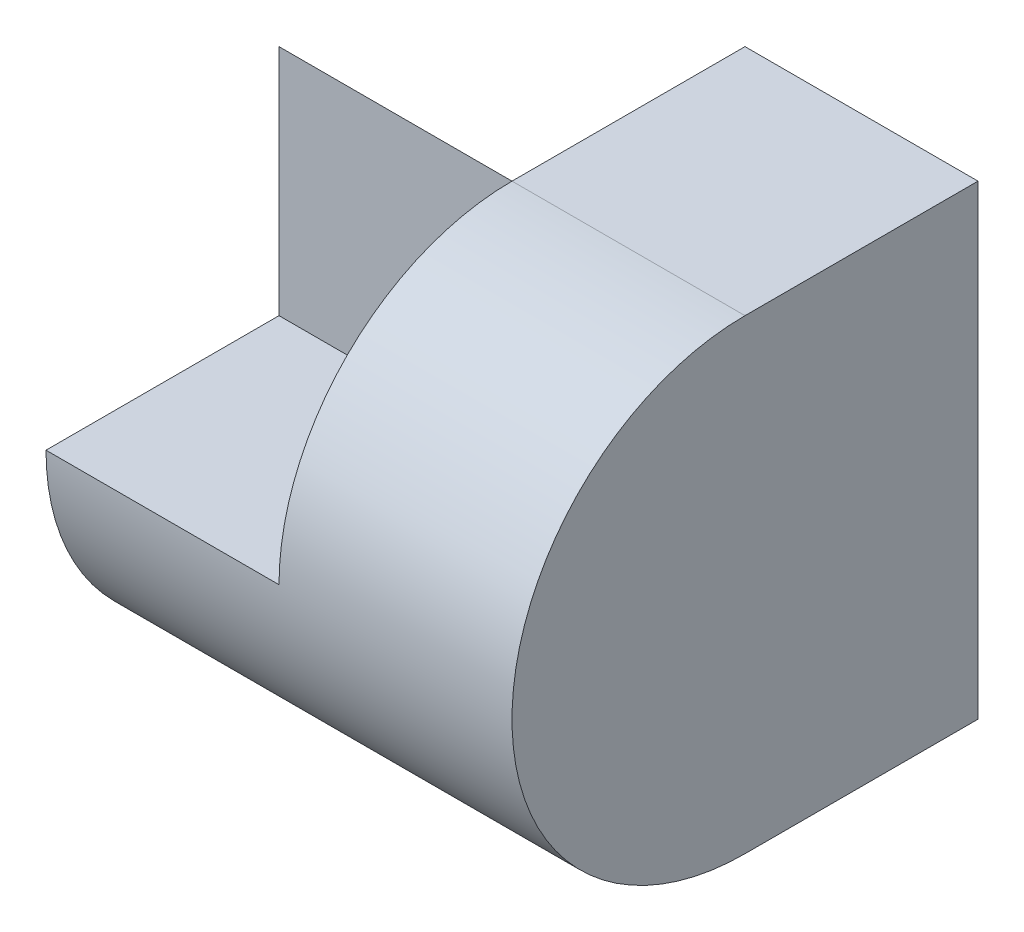
ISO-10303-21;
HEADER;
FILE_DESCRIPTION(('STEP AP214'),'2;1');
FILE_NAME('part.step','',(''),(''),'','','');
FILE_SCHEMA(('AUTOMOTIVE_DESIGN { 1 0 10303 214 1 1 1 1 }'));
ENDSEC;
DATA;
#1=APPLICATION_CONTEXT('core data for automotive mechanical design processes');
#2=APPLICATION_PROTOCOL_DEFINITION('international standard','automotive_design',2000,#1);
#3=PRODUCT_CONTEXT('',#1,'mechanical');
#4=PRODUCT('Part','Part','',(#3));
#5=PRODUCT_RELATED_PRODUCT_CATEGORY('part','',(#4));
#6=PRODUCT_DEFINITION_FORMATION('','',#4);
#7=PRODUCT_DEFINITION_CONTEXT('part definition',#1,'design');
#8=PRODUCT_DEFINITION('design','',#6,#7);
#9=PRODUCT_DEFINITION_SHAPE('','',#8);
#10=(LENGTH_UNIT() NAMED_UNIT(*) SI_UNIT(.MILLI.,.METRE.));
#11=(NAMED_UNIT(*) PLANE_ANGLE_UNIT() SI_UNIT($,.RADIAN.));
#12=(NAMED_UNIT(*) SI_UNIT($,.STERADIAN.) SOLID_ANGLE_UNIT());
#13=UNCERTAINTY_MEASURE_WITH_UNIT(LENGTH_MEASURE(1.E-05),#10,'distance_accuracy_value','');
#14=(GEOMETRIC_REPRESENTATION_CONTEXT(3) GLOBAL_UNCERTAINTY_ASSIGNED_CONTEXT((#13)) GLOBAL_UNIT_ASSIGNED_CONTEXT((#10,
#11,#12)) REPRESENTATION_CONTEXT('',''));
#15=CARTESIAN_POINT('',(0.,0.,0.));
#16=DIRECTION('',(0.,0.,1.));
#17=DIRECTION('',(1.,0.,0.));
#18=AXIS2_PLACEMENT_3D('',#15,#16,#17);
#19=CARTESIAN_POINT('',(2.,4.,2.));
#20=DIRECTION('',(-1.,0.,0.));
#21=DIRECTION('',(0.,0.,1.));
#22=AXIS2_PLACEMENT_3D('',#19,#20,#21);
#23=PLANE('',#22);
#24=CARTESIAN_POINT('',(2.,2.,0.));
#25=DIRECTION('',(-1.,0.,0.));
#26=DIRECTION('',(0.,0.,1.));
#27=AXIS2_PLACEMENT_3D('',#24,#25,#26);
#28=CIRCLE('',#27,2.);
#29=CARTESIAN_POINT('',(2.,4.,0.));
#30=VERTEX_POINT('',#29);
#31=CARTESIAN_POINT('',(2.,0.,0.));
#32=VERTEX_POINT('',#31);
#33=EDGE_CURVE('E168',#30,#32,#28,.F.);
#34=ORIENTED_EDGE('',*,*,#33,.T.);
#35=DIRECTION('',(0.,0.,-1.));
#36=VECTOR('',#35,1.);
#37=CARTESIAN_POINT('',(2.,0.,2.));
#38=LINE('',#37,#36);
#39=CARTESIAN_POINT('',(2.,0.,-2.));
#40=VERTEX_POINT('',#39);
#41=EDGE_CURVE('E107',#32,#40,#38,.T.);
#42=ORIENTED_EDGE('',*,*,#41,.T.);
#43=DIRECTION('',(0.,-1.,0.));
#44=VECTOR('',#43,1.);
#45=CARTESIAN_POINT('',(2.,4.,-2.));
#46=LINE('',#45,#44);
#47=CARTESIAN_POINT('',(2.,4.,-2.));
#48=VERTEX_POINT('',#47);
#49=EDGE_CURVE('E79',#48,#40,#46,.T.);
#50=ORIENTED_EDGE('',*,*,#49,.F.);
#51=DIRECTION('',(0.,0.,-1.));
#52=VECTOR('',#51,1.);
#53=CARTESIAN_POINT('',(2.,4.,2.));
#54=LINE('',#53,#52);
#55=EDGE_CURVE('E93',#30,#48,#54,.T.);
#56=ORIENTED_EDGE('',*,*,#55,.F.);
#57=EDGE_LOOP('',(#34,#42,#50,#56));
#58=FACE_BOUND('',#57,.T.);
#59=ADVANCED_FACE('F72',(#58),#23,.F.);
#60=CARTESIAN_POINT('',(-2.,4.,2.));
#61=DIRECTION('',(1.,0.,0.));
#62=DIRECTION('',(0.,0.,-1.));
#63=AXIS2_PLACEMENT_3D('',#60,#61,#62);
#64=PLANE('',#63);
#65=DIRECTION('',(0.,0.,1.));
#66=VECTOR('',#65,1.);
#67=CARTESIAN_POINT('',(-2.,0.,2.));
#68=LINE('',#67,#66);
#69=CARTESIAN_POINT('',(-2.,0.,-2.));
#70=VERTEX_POINT('',#69);
#71=CARTESIAN_POINT('',(-2.,0.,0.));
#72=VERTEX_POINT('',#71);
#73=EDGE_CURVE('E184',#70,#72,#68,.T.);
#74=ORIENTED_EDGE('',*,*,#73,.T.);
#75=CARTESIAN_POINT('',(-2.,2.,0.));
#76=DIRECTION('',(1.,0.,0.));
#77=DIRECTION('',(0.,0.,-1.));
#78=AXIS2_PLACEMENT_3D('',#75,#76,#77);
#79=CIRCLE('',#78,2.);
#80=CARTESIAN_POINT('',(-2.,2.,2.));
#81=VERTEX_POINT('',#80);
#82=EDGE_CURVE('E201',#72,#81,#79,.F.);
#83=ORIENTED_EDGE('',*,*,#82,.T.);
#84=DIRECTION('',(0.,0.,1.));
#85=VECTOR('',#84,1.);
#86=CARTESIAN_POINT('',(-2.,2.,0.));
#87=LINE('',#86,#85);
#88=CARTESIAN_POINT('',(-2.,2.,0.));
#89=VERTEX_POINT('',#88);
#90=EDGE_CURVE('E154',#89,#81,#87,.T.);
#91=ORIENTED_EDGE('',*,*,#90,.F.);
#92=DIRECTION('',(0.,-1.,0.));
#93=VECTOR('',#92,1.);
#94=CARTESIAN_POINT('',(-2.,0.,0.));
#95=LINE('',#94,#93);
#96=CARTESIAN_POINT('',(-2.,4.,0.));
#97=VERTEX_POINT('',#96);
#98=EDGE_CURVE('E165',#97,#89,#95,.T.);
#99=ORIENTED_EDGE('',*,*,#98,.F.);
#100=DIRECTION('',(0.,0.707106781186548,0.707106781186548));
#101=VECTOR('',#100,1.);
#102=CARTESIAN_POINT('',(-2.,2.,-2.));
#103=LINE('',#102,#101);
#104=CARTESIAN_POINT('',(-2.,2.,-2.));
#105=VERTEX_POINT('',#104);
#106=EDGE_CURVE('E155',#105,#97,#103,.T.);
#107=ORIENTED_EDGE('',*,*,#106,.F.);
#108=DIRECTION('',(0.,-1.,0.));
#109=VECTOR('',#108,1.);
#110=CARTESIAN_POINT('',(-2.,4.,-2.));
#111=LINE('',#110,#109);
#112=EDGE_CURVE('E186',#105,#70,#111,.T.);
#113=ORIENTED_EDGE('',*,*,#112,.T.);
#114=EDGE_LOOP('',(#74,#83,#91,#99,#107,#113));
#115=FACE_BOUND('',#114,.T.);
#116=ADVANCED_FACE('F206',(#115),#64,.F.);
#117=CARTESIAN_POINT('',(0.,0.,0.));
#118=DIRECTION('',(-1.,0.,0.));
#119=DIRECTION('',(0.,0.,1.));
#120=AXIS2_PLACEMENT_3D('',#117,#118,#119);
#121=PLANE('',#120);
#122=CARTESIAN_POINT('',(0.,2.,0.));
#123=DIRECTION('',(-1.,0.,0.));
#124=DIRECTION('',(0.,0.,1.));
#125=AXIS2_PLACEMENT_3D('',#122,#123,#124);
#126=CIRCLE('',#125,2.);
#127=CARTESIAN_POINT('',(0.,4.,0.));
#128=VERTEX_POINT('',#127);
#129=CARTESIAN_POINT('',(0.,2.,2.));
#130=VERTEX_POINT('',#129);
#131=EDGE_CURVE('E12',#128,#130,#126,.F.);
#132=ORIENTED_EDGE('',*,*,#131,.F.);
#133=DIRECTION('',(0.,-1.,0.));
#134=VECTOR('',#133,1.);
#135=CARTESIAN_POINT('',(0.,0.,0.));
#136=LINE('',#135,#134);
#137=CARTESIAN_POINT('',(0.,2.,0.));
#138=VERTEX_POINT('',#137);
#139=EDGE_CURVE('E159',#128,#138,#136,.T.);
#140=ORIENTED_EDGE('',*,*,#139,.T.);
#141=DIRECTION('',(0.,0.,1.));
#142=VECTOR('',#141,1.);
#143=CARTESIAN_POINT('',(0.,2.,0.));
#144=LINE('',#143,#142);
#145=EDGE_CURVE('E152',#138,#130,#144,.T.);
#146=ORIENTED_EDGE('',*,*,#145,.T.);
#147=EDGE_LOOP('',(#132,#140,#146));
#148=FACE_BOUND('',#147,.T.);
#149=ADVANCED_FACE('F158',(#148),#121,.T.);
#150=CARTESIAN_POINT('',(0.,4.,0.));
#151=DIRECTION('',(0.,-1.,0.));
#152=DIRECTION('',(0.,0.,-1.));
#153=AXIS2_PLACEMENT_3D('',#150,#151,#152);
#154=PLANE('',#153);
#155=DIRECTION('',(0.,0.,-1.));
#156=VECTOR('',#155,1.);
#157=CARTESIAN_POINT('',(0.,4.,0.));
#158=LINE('',#157,#156);
#159=CARTESIAN_POINT('',(0.,4.,-2.));
#160=VERTEX_POINT('',#159);
#161=EDGE_CURVE('E115',#128,#160,#158,.T.);
#162=ORIENTED_EDGE('',*,*,#161,.F.);
#163=DIRECTION('',(-1.,0.,0.));
#164=VECTOR('',#163,1.);
#165=CARTESIAN_POINT('',(5.,4.,0.));
#166=LINE('',#165,#164);
#167=EDGE_CURVE('E85',#30,#128,#166,.T.);
#168=ORIENTED_EDGE('',*,*,#167,.F.);
#169=ORIENTED_EDGE('',*,*,#55,.T.);
#170=DIRECTION('',(-1.,0.,0.));
#171=VECTOR('',#170,1.);
#172=CARTESIAN_POINT('',(-2.,4.,-2.));
#173=LINE('',#172,#171);
#174=EDGE_CURVE('E183',#48,#160,#173,.T.);
#175=ORIENTED_EDGE('',*,*,#174,.T.);
#176=EDGE_LOOP('',(#162,#168,#169,#175));
#177=FACE_BOUND('',#176,.T.);
#178=ADVANCED_FACE('F214',(#177),#154,.F.);
#179=CARTESIAN_POINT('',(-2.,4.,-2.));
#180=DIRECTION('',(0.,0.,1.));
#181=DIRECTION('',(1.,0.,0.));
#182=AXIS2_PLACEMENT_3D('',#179,#180,#181);
#183=PLANE('',#182);
#184=ORIENTED_EDGE('',*,*,#112,.F.);
#185=DIRECTION('',(-1.,0.,0.));
#186=VECTOR('',#185,1.);
#187=CARTESIAN_POINT('',(0.,2.,-2.));
#188=LINE('',#187,#186);
#189=CARTESIAN_POINT('',(0.,2.,-2.));
#190=VERTEX_POINT('',#189);
#191=EDGE_CURVE('E175',#190,#105,#188,.T.);
#192=ORIENTED_EDGE('',*,*,#191,.F.);
#193=DIRECTION('',(0.,-1.,0.));
#194=VECTOR('',#193,1.);
#195=CARTESIAN_POINT('',(0.,0.,-2.));
#196=LINE('',#195,#194);
#197=EDGE_CURVE('E170',#160,#190,#196,.T.);
#198=ORIENTED_EDGE('',*,*,#197,.F.);
#199=ORIENTED_EDGE('',*,*,#174,.F.);
#200=ORIENTED_EDGE('',*,*,#49,.T.);
#201=DIRECTION('',(-1.,0.,0.));
#202=VECTOR('',#201,1.);
#203=CARTESIAN_POINT('',(-2.,0.,-2.));
#204=LINE('',#203,#202);
#205=EDGE_CURVE('E188',#40,#70,#204,.T.);
#206=ORIENTED_EDGE('',*,*,#205,.T.);
#207=EDGE_LOOP('',(#184,#192,#198,#199,#200,#206));
#208=FACE_BOUND('',#207,.T.);
#209=ADVANCED_FACE('F196',(#208),#183,.F.);
#210=CARTESIAN_POINT('',(0.,0.,0.));
#211=DIRECTION('',(0.,-1.,0.));
#212=DIRECTION('',(0.,0.,-1.));
#213=AXIS2_PLACEMENT_3D('',#210,#211,#212);
#214=PLANE('',#213);
#215=DIRECTION('',(-1.,0.,0.));
#216=VECTOR('',#215,1.);
#217=CARTESIAN_POINT('',(5.,0.,0.));
#218=LINE('',#217,#216);
#219=EDGE_CURVE('E200',#32,#72,#218,.T.);
#220=ORIENTED_EDGE('',*,*,#219,.T.);
#221=ORIENTED_EDGE('',*,*,#73,.F.);
#222=ORIENTED_EDGE('',*,*,#205,.F.);
#223=ORIENTED_EDGE('',*,*,#41,.F.);
#224=EDGE_LOOP('',(#220,#221,#222,#223));
#225=FACE_BOUND('',#224,.T.);
#226=ADVANCED_FACE('F204',(#225),#214,.T.);
#227=CARTESIAN_POINT('',(0.,2.,-2.));
#228=DIRECTION('',(0.,-0.707106781186547,0.707106781186547));
#229=DIRECTION('',(0.,-0.707106781186548,-0.707106781186548));
#230=AXIS2_PLACEMENT_3D('',#227,#228,#229);
#231=PLANE('',#230);
#232=ORIENTED_EDGE('',*,*,#106,.T.);
#233=DIRECTION('',(-1.,0.,0.));
#234=VECTOR('',#233,1.);
#235=CARTESIAN_POINT('',(0.,4.,0.));
#236=LINE('',#235,#234);
#237=EDGE_CURVE('E178',#128,#97,#236,.T.);
#238=ORIENTED_EDGE('',*,*,#237,.F.);
#239=DIRECTION('',(0.,0.707106781186548,0.707106781186548));
#240=VECTOR('',#239,1.);
#241=CARTESIAN_POINT('',(0.,2.,-2.));
#242=LINE('',#241,#240);
#243=EDGE_CURVE('E172',#190,#128,#242,.T.);
#244=ORIENTED_EDGE('',*,*,#243,.F.);
#245=ORIENTED_EDGE('',*,*,#191,.T.);
#246=EDGE_LOOP('',(#232,#238,#244,#245));
#247=FACE_BOUND('',#246,.T.);
#248=ADVANCED_FACE('F211',(#247),#231,.F.);
#249=CARTESIAN_POINT('',(0.,0.,0.));
#250=DIRECTION('',(-1.,0.,0.));
#251=DIRECTION('',(0.,0.,1.));
#252=AXIS2_PLACEMENT_3D('',#249,#250,#251);
#253=PLANE('',#252);
#254=ORIENTED_EDGE('',*,*,#197,.T.);
#255=ORIENTED_EDGE('',*,*,#243,.T.);
#256=ORIENTED_EDGE('',*,*,#161,.T.);
#257=EDGE_LOOP('',(#254,#255,#256));
#258=FACE_BOUND('',#257,.T.);
#259=ADVANCED_FACE('F213',(#258),#253,.T.);
#260=CARTESIAN_POINT('',(0.,0.,0.));
#261=DIRECTION('',(0.,0.,-1.));
#262=DIRECTION('',(-1.,0.,0.));
#263=AXIS2_PLACEMENT_3D('',#260,#261,#262);
#264=PLANE('',#263);
#265=ORIENTED_EDGE('',*,*,#98,.T.);
#266=DIRECTION('',(-1.,0.,0.));
#267=VECTOR('',#266,1.);
#268=CARTESIAN_POINT('',(0.,2.,0.));
#269=LINE('',#268,#267);
#270=EDGE_CURVE('E156',#138,#89,#269,.T.);
#271=ORIENTED_EDGE('',*,*,#270,.F.);
#272=ORIENTED_EDGE('',*,*,#139,.F.);
#273=ORIENTED_EDGE('',*,*,#237,.T.);
#274=EDGE_LOOP('',(#265,#271,#272,#273));
#275=FACE_BOUND('',#274,.T.);
#276=ADVANCED_FACE('F240',(#275),#264,.F.);
#277=CARTESIAN_POINT('',(0.,2.,0.));
#278=DIRECTION('',(0.,-1.,0.));
#279=DIRECTION('',(0.,0.,-1.));
#280=AXIS2_PLACEMENT_3D('',#277,#278,#279);
#281=PLANE('',#280);
#282=ORIENTED_EDGE('',*,*,#90,.T.);
#283=DIRECTION('',(-1.,0.,0.));
#284=VECTOR('',#283,1.);
#285=CARTESIAN_POINT('',(0.,2.,2.));
#286=LINE('',#285,#284);
#287=EDGE_CURVE('E142',#130,#81,#286,.T.);
#288=ORIENTED_EDGE('',*,*,#287,.F.);
#289=ORIENTED_EDGE('',*,*,#145,.F.);
#290=ORIENTED_EDGE('',*,*,#270,.T.);
#291=EDGE_LOOP('',(#282,#288,#289,#290));
#292=FACE_BOUND('',#291,.T.);
#293=ADVANCED_FACE('F151',(#292),#281,.F.);
#294=CARTESIAN_POINT('',(5.,2.,0.));
#295=DIRECTION('',(-1.,0.,0.));
#296=DIRECTION('',(0.,0.,1.));
#297=AXIS2_PLACEMENT_3D('',#294,#295,#296);
#298=CYLINDRICAL_SURFACE('',#297,2.);
#299=ORIENTED_EDGE('',*,*,#167,.T.);
#300=ORIENTED_EDGE('',*,*,#131,.T.);
#301=ORIENTED_EDGE('',*,*,#287,.T.);
#302=ORIENTED_EDGE('',*,*,#82,.F.);
#303=ORIENTED_EDGE('',*,*,#219,.F.);
#304=ORIENTED_EDGE('',*,*,#33,.F.);
#305=EDGE_LOOP('',(#299,#300,#301,#302,#303,#304));
#306=FACE_BOUND('',#305,.T.);
#307=ADVANCED_FACE('F141',(#306),#298,.T.);
#308=CLOSED_SHELL('',(#59,#116,#149,#178,#209,#226,#248,#259,#276,#293,#307));
#309=MANIFOLD_SOLID_BREP('B2',#308);
#310=ADVANCED_BREP_SHAPE_REPRESENTATION('',(#18,#309),#14);
#311=SHAPE_DEFINITION_REPRESENTATION(#9,#310);
ENDSEC;
END-ISO-10303-21;
